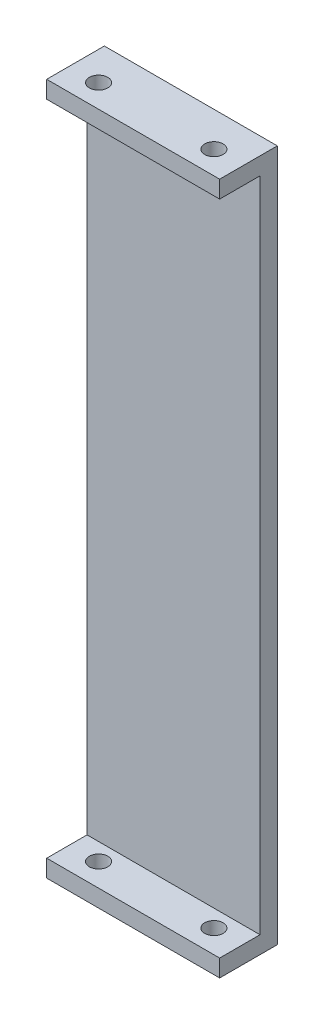
ISO-10303-21;
HEADER;
FILE_DESCRIPTION(('STEP AP214'),'2;1');
FILE_NAME('part.step','',(''),(''),'','','');
FILE_SCHEMA(('AUTOMOTIVE_DESIGN { 1 0 10303 214 1 1 1 1 }'));
ENDSEC;
DATA;
#1=APPLICATION_CONTEXT('core data for automotive mechanical design processes');
#2=APPLICATION_PROTOCOL_DEFINITION('international standard','automotive_design',2000,#1);
#3=PRODUCT_CONTEXT('',#1,'mechanical');
#4=PRODUCT('Part','Part','',(#3));
#5=PRODUCT_RELATED_PRODUCT_CATEGORY('part','',(#4));
#6=PRODUCT_DEFINITION_FORMATION('','',#4);
#7=PRODUCT_DEFINITION_CONTEXT('part definition',#1,'design');
#8=PRODUCT_DEFINITION('design','',#6,#7);
#9=PRODUCT_DEFINITION_SHAPE('','',#8);
#10=(LENGTH_UNIT() NAMED_UNIT(*) SI_UNIT(.MILLI.,.METRE.));
#11=(NAMED_UNIT(*) PLANE_ANGLE_UNIT() SI_UNIT($,.RADIAN.));
#12=(NAMED_UNIT(*) SI_UNIT($,.STERADIAN.) SOLID_ANGLE_UNIT());
#13=UNCERTAINTY_MEASURE_WITH_UNIT(LENGTH_MEASURE(1.E-05),#10,'distance_accuracy_value','');
#14=(GEOMETRIC_REPRESENTATION_CONTEXT(3) GLOBAL_UNCERTAINTY_ASSIGNED_CONTEXT((#13)) GLOBAL_UNIT_ASSIGNED_CONTEXT((#10,
#11,#12)) REPRESENTATION_CONTEXT('',''));
#15=CARTESIAN_POINT('',(0.,0.,0.));
#16=DIRECTION('',(0.,0.,1.));
#17=DIRECTION('',(1.,0.,0.));
#18=AXIS2_PLACEMENT_3D('',#15,#16,#17);
#19=CARTESIAN_POINT('',(0.,0.,10.));
#20=DIRECTION('',(0.,0.,1.));
#21=DIRECTION('',(1.,0.,0.));
#22=AXIS2_PLACEMENT_3D('',#19,#20,#21);
#23=PLANE('',#22);
#24=DIRECTION('',(-1.,0.,0.));
#25=VECTOR('',#24,1.);
#26=CARTESIAN_POINT('',(-10.0858421947135,111.268009127007,10.));
#27=LINE('',#26,#25);
#28=CARTESIAN_POINT('',(19.9141578052865,111.268009127007,10.));
#29=VERTEX_POINT('',#28);
#30=CARTESIAN_POINT('',(-10.0858421947135,111.268009127007,10.));
#31=VERTEX_POINT('',#30);
#32=EDGE_CURVE('E130',#29,#31,#27,.T.);
#33=ORIENTED_EDGE('',*,*,#32,.F.);
#34=DIRECTION('',(0.,1.,0.));
#35=VECTOR('',#34,1.);
#36=CARTESIAN_POINT('',(19.9141578052865,114.268009127007,10.));
#37=LINE('',#36,#35);
#38=CARTESIAN_POINT('',(19.9141578052865,114.268009127007,10.));
#39=VERTEX_POINT('',#38);
#40=EDGE_CURVE('E143',#29,#39,#37,.T.);
#41=ORIENTED_EDGE('',*,*,#40,.T.);
#42=DIRECTION('',(-1.,0.,0.));
#43=VECTOR('',#42,1.);
#44=CARTESIAN_POINT('',(-10.0858421947135,114.268009127007,10.));
#45=LINE('',#44,#43);
#46=CARTESIAN_POINT('',(-10.0858421947135,114.268009127007,10.));
#47=VERTEX_POINT('',#46);
#48=EDGE_CURVE('E64',#39,#47,#45,.T.);
#49=ORIENTED_EDGE('',*,*,#48,.T.);
#50=DIRECTION('',(0.,-1.,0.));
#51=VECTOR('',#50,1.);
#52=CARTESIAN_POINT('',(-10.0858421947135,114.268009127007,10.));
#53=LINE('',#52,#51);
#54=EDGE_CURVE('E139',#47,#31,#53,.T.);
#55=ORIENTED_EDGE('',*,*,#54,.T.);
#56=EDGE_LOOP('',(#33,#41,#49,#55));
#57=FACE_BOUND('',#56,.T.);
#58=ADVANCED_FACE('F38',(#57),#23,.T.);
#59=CARTESIAN_POINT('',(-10.0858421947135,114.268009127007,10.));
#60=DIRECTION('',(1.,0.,0.));
#61=DIRECTION('',(0.,1.,0.));
#62=AXIS2_PLACEMENT_3D('',#59,#60,#61);
#63=PLANE('',#62);
#64=DIRECTION('',(0.,-1.,0.));
#65=VECTOR('',#64,1.);
#66=CARTESIAN_POINT('',(-10.0858421947135,-2.73199087299339,3.));
#67=LINE('',#66,#65);
#68=CARTESIAN_POINT('',(-10.0858421947135,111.268009127007,3.));
#69=VERTEX_POINT('',#68);
#70=CARTESIAN_POINT('',(-10.0858421947135,-2.73199087299339,3.));
#71=VERTEX_POINT('',#70);
#72=EDGE_CURVE('E121',#69,#71,#67,.T.);
#73=ORIENTED_EDGE('',*,*,#72,.F.);
#74=DIRECTION('',(0.,0.,1.));
#75=VECTOR('',#74,1.);
#76=CARTESIAN_POINT('',(-10.0858421947135,111.268009127007,3.));
#77=LINE('',#76,#75);
#78=EDGE_CURVE('E153',#69,#31,#77,.T.);
#79=ORIENTED_EDGE('',*,*,#78,.T.);
#80=ORIENTED_EDGE('',*,*,#54,.F.);
#81=DIRECTION('',(0.,0.,-1.));
#82=VECTOR('',#81,1.);
#83=CARTESIAN_POINT('',(-10.0858421947135,114.268009127007,10.));
#84=LINE('',#83,#82);
#85=CARTESIAN_POINT('',(-10.0858421947135,114.268009127007,0.));
#86=VERTEX_POINT('',#85);
#87=EDGE_CURVE('E148',#47,#86,#84,.T.);
#88=ORIENTED_EDGE('',*,*,#87,.T.);
#89=DIRECTION('',(0.,-1.,0.));
#90=VECTOR('',#89,1.);
#91=CARTESIAN_POINT('',(-10.0858421947135,114.268009127007,0.));
#92=LINE('',#91,#90);
#93=CARTESIAN_POINT('',(-10.0858421947135,-5.7319908729934,0.));
#94=VERTEX_POINT('',#93);
#95=EDGE_CURVE('E149',#86,#94,#92,.T.);
#96=ORIENTED_EDGE('',*,*,#95,.T.);
#97=DIRECTION('',(0.,0.,-1.));
#98=VECTOR('',#97,1.);
#99=CARTESIAN_POINT('',(-10.0858421947135,-5.7319908729934,10.));
#100=LINE('',#99,#98);
#101=CARTESIAN_POINT('',(-10.0858421947135,-5.7319908729934,10.));
#102=VERTEX_POINT('',#101);
#103=EDGE_CURVE('E11',#102,#94,#100,.T.);
#104=ORIENTED_EDGE('',*,*,#103,.F.);
#105=CARTESIAN_POINT('',(-10.0858421947135,-2.73199087299339,10.));
#106=VERTEX_POINT('',#105);
#107=EDGE_CURVE('E92',#106,#102,#53,.T.);
#108=ORIENTED_EDGE('',*,*,#107,.F.);
#109=DIRECTION('',(0.,0.,1.));
#110=VECTOR('',#109,1.);
#111=CARTESIAN_POINT('',(-10.0858421947135,-2.73199087299339,3.));
#112=LINE('',#111,#110);
#113=EDGE_CURVE('E55',#71,#106,#112,.T.);
#114=ORIENTED_EDGE('',*,*,#113,.F.);
#115=EDGE_LOOP('',(#73,#79,#80,#88,#96,#104,#108,#114));
#116=FACE_BOUND('',#115,.T.);
#117=ADVANCED_FACE('F40',(#116),#63,.F.);
#118=CARTESIAN_POINT('',(-10.0858421947135,-5.7319908729934,10.));
#119=DIRECTION('',(0.,1.,0.));
#120=DIRECTION('',(0.,0.,1.));
#121=AXIS2_PLACEMENT_3D('',#118,#119,#120);
#122=PLANE('',#121);
#123=CARTESIAN_POINT('',(-5.08584219471352,-5.73199087299339,6.));
#124=DIRECTION('',(0.,1.,0.));
#125=DIRECTION('',(0.,0.,1.));
#126=AXIS2_PLACEMENT_3D('',#123,#124,#125);
#127=CIRCLE('',#126,1.6);
#128=CARTESIAN_POINT('',(-5.08584219471352,-5.73199087299339,7.6));
#129=VERTEX_POINT('',#128);
#130=EDGE_CURVE('E165',#129,#129,#127,.T.);
#131=ORIENTED_EDGE('',*,*,#130,.T.);
#132=EDGE_LOOP('',(#131));
#133=FACE_BOUND('',#132,.T.);
#134=CARTESIAN_POINT('',(14.9141578052865,-5.73199087299339,6.));
#135=DIRECTION('',(0.,1.,0.));
#136=DIRECTION('',(0.,0.,1.));
#137=AXIS2_PLACEMENT_3D('',#134,#135,#136);
#138=CIRCLE('',#137,1.6);
#139=CARTESIAN_POINT('',(14.9141578052865,-5.73199087299339,7.6));
#140=VERTEX_POINT('',#139);
#141=EDGE_CURVE('E181',#140,#140,#138,.T.);
#142=ORIENTED_EDGE('',*,*,#141,.T.);
#143=EDGE_LOOP('',(#142));
#144=FACE_BOUND('',#143,.T.);
#145=DIRECTION('',(1.,0.,0.));
#146=VECTOR('',#145,1.);
#147=CARTESIAN_POINT('',(-10.0858421947135,-5.7319908729934,0.));
#148=LINE('',#147,#146);
#149=CARTESIAN_POINT('',(19.9141578052865,-5.7319908729934,0.));
#150=VERTEX_POINT('',#149);
#151=EDGE_CURVE('E152',#94,#150,#148,.T.);
#152=ORIENTED_EDGE('',*,*,#151,.T.);
#153=DIRECTION('',(0.,0.,-1.));
#154=VECTOR('',#153,1.);
#155=CARTESIAN_POINT('',(19.9141578052865,-5.7319908729934,10.));
#156=LINE('',#155,#154);
#157=CARTESIAN_POINT('',(19.9141578052865,-5.7319908729934,10.));
#158=VERTEX_POINT('',#157);
#159=EDGE_CURVE('E47',#158,#150,#156,.T.);
#160=ORIENTED_EDGE('',*,*,#159,.F.);
#161=DIRECTION('',(1.,0.,0.));
#162=VECTOR('',#161,1.);
#163=CARTESIAN_POINT('',(-10.0858421947135,-5.7319908729934,10.));
#164=LINE('',#163,#162);
#165=EDGE_CURVE('E141',#102,#158,#164,.T.);
#166=ORIENTED_EDGE('',*,*,#165,.F.);
#167=ORIENTED_EDGE('',*,*,#103,.T.);
#168=EDGE_LOOP('',(#152,#160,#166,#167));
#169=FACE_BOUND('',#168,.T.);
#170=ADVANCED_FACE('F207',(#133,#144,#169),#122,.F.);
#171=CARTESIAN_POINT('',(19.9141578052865,114.268009127007,10.));
#172=DIRECTION('',(-1.,0.,0.));
#173=DIRECTION('',(0.,-1.,0.));
#174=AXIS2_PLACEMENT_3D('',#171,#172,#173);
#175=PLANE('',#174);
#176=ORIENTED_EDGE('',*,*,#40,.F.);
#177=DIRECTION('',(0.,0.,1.));
#178=VECTOR('',#177,1.);
#179=CARTESIAN_POINT('',(19.9141578052865,111.268009127007,3.));
#180=LINE('',#179,#178);
#181=CARTESIAN_POINT('',(19.9141578052865,111.268009127007,3.));
#182=VERTEX_POINT('',#181);
#183=EDGE_CURVE('E134',#182,#29,#180,.T.);
#184=ORIENTED_EDGE('',*,*,#183,.F.);
#185=DIRECTION('',(0.,1.,0.));
#186=VECTOR('',#185,1.);
#187=CARTESIAN_POINT('',(19.9141578052865,-2.7319908729934,3.));
#188=LINE('',#187,#186);
#189=CARTESIAN_POINT('',(19.9141578052865,-2.7319908729934,3.));
#190=VERTEX_POINT('',#189);
#191=EDGE_CURVE('E120',#190,#182,#188,.T.);
#192=ORIENTED_EDGE('',*,*,#191,.F.);
#193=DIRECTION('',(0.,0.,1.));
#194=VECTOR('',#193,1.);
#195=CARTESIAN_POINT('',(19.9141578052865,-2.7319908729934,3.));
#196=LINE('',#195,#194);
#197=CARTESIAN_POINT('',(19.9141578052865,-2.7319908729934,10.));
#198=VERTEX_POINT('',#197);
#199=EDGE_CURVE('E117',#190,#198,#196,.T.);
#200=ORIENTED_EDGE('',*,*,#199,.T.);
#201=EDGE_CURVE('E144',#158,#198,#37,.T.);
#202=ORIENTED_EDGE('',*,*,#201,.F.);
#203=ORIENTED_EDGE('',*,*,#159,.T.);
#204=DIRECTION('',(0.,1.,0.));
#205=VECTOR('',#204,1.);
#206=CARTESIAN_POINT('',(19.9141578052865,114.268009127007,0.));
#207=LINE('',#206,#205);
#208=CARTESIAN_POINT('',(19.9141578052865,114.268009127007,0.));
#209=VERTEX_POINT('',#208);
#210=EDGE_CURVE('E155',#150,#209,#207,.T.);
#211=ORIENTED_EDGE('',*,*,#210,.T.);
#212=DIRECTION('',(0.,0.,-1.));
#213=VECTOR('',#212,1.);
#214=CARTESIAN_POINT('',(19.9141578052865,114.268009127007,10.));
#215=LINE('',#214,#213);
#216=EDGE_CURVE('E159',#39,#209,#215,.T.);
#217=ORIENTED_EDGE('',*,*,#216,.F.);
#218=EDGE_LOOP('',(#176,#184,#192,#200,#202,#203,#211,#217));
#219=FACE_BOUND('',#218,.T.);
#220=ADVANCED_FACE('F199',(#219),#175,.F.);
#221=CARTESIAN_POINT('',(-10.0858421947135,114.268009127007,10.));
#222=DIRECTION('',(0.,-1.,0.));
#223=DIRECTION('',(0.,0.,-1.));
#224=AXIS2_PLACEMENT_3D('',#221,#222,#223);
#225=PLANE('',#224);
#226=CARTESIAN_POINT('',(-5.08584219471352,114.268009127007,6.));
#227=DIRECTION('',(0.,1.,0.));
#228=DIRECTION('',(0.,0.,1.));
#229=AXIS2_PLACEMENT_3D('',#226,#227,#228);
#230=CIRCLE('',#229,1.6);
#231=CARTESIAN_POINT('',(-5.08584219471352,114.268009127007,7.6));
#232=VERTEX_POINT('',#231);
#233=EDGE_CURVE('E171',#232,#232,#230,.T.);
#234=ORIENTED_EDGE('',*,*,#233,.F.);
#235=EDGE_LOOP('',(#234));
#236=FACE_BOUND('',#235,.T.);
#237=CARTESIAN_POINT('',(14.9141578052865,114.268009127007,6.));
#238=DIRECTION('',(0.,1.,0.));
#239=DIRECTION('',(0.,0.,1.));
#240=AXIS2_PLACEMENT_3D('',#237,#238,#239);
#241=CIRCLE('',#240,1.6);
#242=CARTESIAN_POINT('',(14.9141578052865,114.268009127007,7.6));
#243=VERTEX_POINT('',#242);
#244=EDGE_CURVE('E176',#243,#243,#241,.T.);
#245=ORIENTED_EDGE('',*,*,#244,.F.);
#246=EDGE_LOOP('',(#245));
#247=FACE_BOUND('',#246,.T.);
#248=DIRECTION('',(-1.,0.,0.));
#249=VECTOR('',#248,1.);
#250=CARTESIAN_POINT('',(-10.0858421947135,114.268009127007,0.));
#251=LINE('',#250,#249);
#252=EDGE_CURVE('E85',#209,#86,#251,.T.);
#253=ORIENTED_EDGE('',*,*,#252,.T.);
#254=ORIENTED_EDGE('',*,*,#87,.F.);
#255=ORIENTED_EDGE('',*,*,#48,.F.);
#256=ORIENTED_EDGE('',*,*,#216,.T.);
#257=EDGE_LOOP('',(#253,#254,#255,#256));
#258=FACE_BOUND('',#257,.T.);
#259=ADVANCED_FACE('F201',(#236,#247,#258),#225,.F.);
#260=DIRECTION('',(1.,0.,0.));
#261=VECTOR('',#260,1.);
#262=CARTESIAN_POINT('',(-10.0858421947135,-2.73199087299339,10.));
#263=LINE('',#262,#261);
#264=EDGE_CURVE('E186',#106,#198,#263,.T.);
#265=ORIENTED_EDGE('',*,*,#264,.F.);
#266=ORIENTED_EDGE('',*,*,#107,.T.);
#267=ORIENTED_EDGE('',*,*,#165,.T.);
#268=ORIENTED_EDGE('',*,*,#201,.T.);
#269=EDGE_LOOP('',(#265,#266,#267,#268));
#270=FACE_BOUND('',#269,.T.);
#271=ADVANCED_FACE('F209',(#270),#23,.T.);
#272=CARTESIAN_POINT('',(0.,0.,0.));
#273=DIRECTION('',(0.,0.,1.));
#274=DIRECTION('',(1.,0.,0.));
#275=AXIS2_PLACEMENT_3D('',#272,#273,#274);
#276=PLANE('',#275);
#277=ORIENTED_EDGE('',*,*,#95,.F.);
#278=ORIENTED_EDGE('',*,*,#252,.F.);
#279=ORIENTED_EDGE('',*,*,#210,.F.);
#280=ORIENTED_EDGE('',*,*,#151,.F.);
#281=EDGE_LOOP('',(#277,#278,#279,#280));
#282=FACE_BOUND('',#281,.T.);
#283=ADVANCED_FACE('F204',(#282),#276,.F.);
#284=CARTESIAN_POINT('',(-10.0858421947135,111.268009127007,3.));
#285=DIRECTION('',(0.,1.,0.));
#286=DIRECTION('',(0.,0.,1.));
#287=AXIS2_PLACEMENT_3D('',#284,#285,#286);
#288=PLANE('',#287);
#289=CARTESIAN_POINT('',(-5.08584219471352,111.268009127007,6.));
#290=DIRECTION('',(0.,1.,0.));
#291=DIRECTION('',(0.,0.,1.));
#292=AXIS2_PLACEMENT_3D('',#289,#290,#291);
#293=CIRCLE('',#292,1.6);
#294=CARTESIAN_POINT('',(-5.08584219471352,111.268009127007,7.6));
#295=VERTEX_POINT('',#294);
#296=EDGE_CURVE('E184',#295,#295,#293,.T.);
#297=ORIENTED_EDGE('',*,*,#296,.T.);
#298=EDGE_LOOP('',(#297));
#299=FACE_BOUND('',#298,.T.);
#300=CARTESIAN_POINT('',(14.9141578052865,111.268009127007,6.));
#301=DIRECTION('',(0.,1.,0.));
#302=DIRECTION('',(0.,0.,1.));
#303=AXIS2_PLACEMENT_3D('',#300,#301,#302);
#304=CIRCLE('',#303,1.6);
#305=CARTESIAN_POINT('',(14.9141578052865,111.268009127007,7.6));
#306=VERTEX_POINT('',#305);
#307=EDGE_CURVE('E164',#306,#306,#304,.T.);
#308=ORIENTED_EDGE('',*,*,#307,.T.);
#309=EDGE_LOOP('',(#308));
#310=FACE_BOUND('',#309,.T.);
#311=ORIENTED_EDGE('',*,*,#32,.T.);
#312=ORIENTED_EDGE('',*,*,#78,.F.);
#313=DIRECTION('',(-1.,0.,0.));
#314=VECTOR('',#313,1.);
#315=CARTESIAN_POINT('',(-10.0858421947135,111.268009127007,3.));
#316=LINE('',#315,#314);
#317=EDGE_CURVE('E127',#182,#69,#316,.T.);
#318=ORIENTED_EDGE('',*,*,#317,.F.);
#319=ORIENTED_EDGE('',*,*,#183,.T.);
#320=EDGE_LOOP('',(#311,#312,#318,#319));
#321=FACE_BOUND('',#320,.T.);
#322=ADVANCED_FACE('F194',(#299,#310,#321),#288,.F.);
#323=CARTESIAN_POINT('',(-10.0858421947135,-2.73199087299339,3.));
#324=DIRECTION('',(0.,-1.,0.));
#325=DIRECTION('',(1.,0.,0.));
#326=AXIS2_PLACEMENT_3D('',#323,#324,#325);
#327=PLANE('',#326);
#328=CARTESIAN_POINT('',(-5.08584219471352,-2.73199087299339,6.));
#329=DIRECTION('',(0.,-1.,0.));
#330=DIRECTION('',(1.,0.,0.));
#331=AXIS2_PLACEMENT_3D('',#328,#329,#330);
#332=CIRCLE('',#331,1.6);
#333=CARTESIAN_POINT('',(-3.48584219471352,-2.73199087299339,6.));
#334=VERTEX_POINT('',#333);
#335=EDGE_CURVE('E42',#334,#334,#332,.T.);
#336=ORIENTED_EDGE('',*,*,#335,.T.);
#337=EDGE_LOOP('',(#336));
#338=FACE_BOUND('',#337,.T.);
#339=CARTESIAN_POINT('',(14.9141578052865,-2.73199087299339,6.));
#340=DIRECTION('',(0.,-1.,0.));
#341=DIRECTION('',(1.,0.,0.));
#342=AXIS2_PLACEMENT_3D('',#339,#340,#341);
#343=CIRCLE('',#342,1.6);
#344=CARTESIAN_POINT('',(16.5141578052865,-2.7319908729934,6.));
#345=VERTEX_POINT('',#344);
#346=EDGE_CURVE('E162',#345,#345,#343,.T.);
#347=ORIENTED_EDGE('',*,*,#346,.T.);
#348=EDGE_LOOP('',(#347));
#349=FACE_BOUND('',#348,.T.);
#350=ORIENTED_EDGE('',*,*,#264,.T.);
#351=ORIENTED_EDGE('',*,*,#199,.F.);
#352=DIRECTION('',(1.,0.,0.));
#353=VECTOR('',#352,1.);
#354=CARTESIAN_POINT('',(-10.0858421947135,-2.73199087299339,3.));
#355=LINE('',#354,#353);
#356=EDGE_CURVE('E113',#71,#190,#355,.T.);
#357=ORIENTED_EDGE('',*,*,#356,.F.);
#358=ORIENTED_EDGE('',*,*,#113,.T.);
#359=EDGE_LOOP('',(#350,#351,#357,#358));
#360=FACE_BOUND('',#359,.T.);
#361=ADVANCED_FACE('F115',(#338,#349,#360),#327,.F.);
#362=CARTESIAN_POINT('',(0.,0.,3.));
#363=DIRECTION('',(0.,0.,-1.));
#364=DIRECTION('',(-1.,0.,0.));
#365=AXIS2_PLACEMENT_3D('',#362,#363,#364);
#366=PLANE('',#365);
#367=ORIENTED_EDGE('',*,*,#72,.T.);
#368=ORIENTED_EDGE('',*,*,#356,.T.);
#369=ORIENTED_EDGE('',*,*,#191,.T.);
#370=ORIENTED_EDGE('',*,*,#317,.T.);
#371=EDGE_LOOP('',(#367,#368,#369,#370));
#372=FACE_BOUND('',#371,.T.);
#373=ADVANCED_FACE('F125',(#372),#366,.F.);
#374=CARTESIAN_POINT('',(14.9141578052865,-5.73199087299339,6.));
#375=DIRECTION('',(0.,1.,0.));
#376=DIRECTION('',(0.,0.,1.));
#377=AXIS2_PLACEMENT_3D('',#374,#375,#376);
#378=CYLINDRICAL_SURFACE('',#377,1.6);
#379=ORIENTED_EDGE('',*,*,#141,.F.);
#380=EDGE_LOOP('',(#379));
#381=FACE_BOUND('',#380,.T.);
#382=ORIENTED_EDGE('',*,*,#346,.F.);
#383=EDGE_LOOP('',(#382));
#384=FACE_BOUND('',#383,.T.);
#385=ADVANCED_FACE('F234',(#381,#384),#378,.F.);
#386=CARTESIAN_POINT('',(-5.08584219471352,-5.73199087299339,6.));
#387=DIRECTION('',(0.,1.,0.));
#388=DIRECTION('',(0.,0.,1.));
#389=AXIS2_PLACEMENT_3D('',#386,#387,#388);
#390=CYLINDRICAL_SURFACE('',#389,1.6);
#391=ORIENTED_EDGE('',*,*,#130,.F.);
#392=EDGE_LOOP('',(#391));
#393=FACE_BOUND('',#392,.T.);
#394=ORIENTED_EDGE('',*,*,#335,.F.);
#395=EDGE_LOOP('',(#394));
#396=FACE_BOUND('',#395,.T.);
#397=ADVANCED_FACE('F237',(#393,#396),#390,.F.);
#398=ORIENTED_EDGE('',*,*,#244,.T.);
#399=EDGE_LOOP('',(#398));
#400=FACE_BOUND('',#399,.T.);
#401=ORIENTED_EDGE('',*,*,#307,.F.);
#402=EDGE_LOOP('',(#401));
#403=FACE_BOUND('',#402,.T.);
#404=ADVANCED_FACE('F239',(#400,#403),#378,.F.);
#405=ORIENTED_EDGE('',*,*,#233,.T.);
#406=EDGE_LOOP('',(#405));
#407=FACE_BOUND('',#406,.T.);
#408=ORIENTED_EDGE('',*,*,#296,.F.);
#409=EDGE_LOOP('',(#408));
#410=FACE_BOUND('',#409,.T.);
#411=ADVANCED_FACE('F246',(#407,#410),#390,.F.);
#412=CLOSED_SHELL('',(#58,#117,#170,#220,#259,#271,#283,#322,#361,#373,#385,#397,#404,#411));
#413=MANIFOLD_SOLID_BREP('B2',#412);
#414=ADVANCED_BREP_SHAPE_REPRESENTATION('',(#18,#413),#14);
#415=SHAPE_DEFINITION_REPRESENTATION(#9,#414);
ENDSEC;
END-ISO-10303-21;
